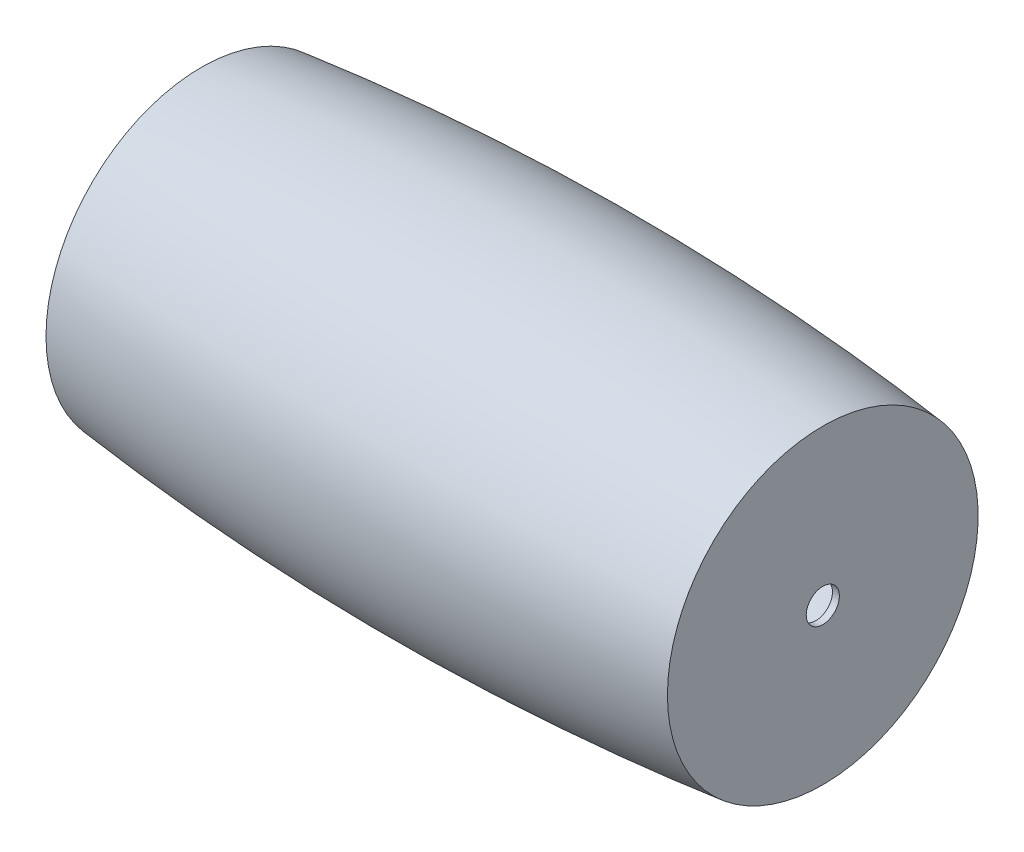
ISO-10303-21;
HEADER;
FILE_DESCRIPTION(('STEP AP214'),'2;1');
FILE_NAME('part.step','',(''),(''),'','','');
FILE_SCHEMA(('AUTOMOTIVE_DESIGN { 1 0 10303 214 1 1 1 1 }'));
ENDSEC;
DATA;
#1=APPLICATION_CONTEXT('core data for automotive mechanical design processes');
#2=APPLICATION_PROTOCOL_DEFINITION('international standard','automotive_design',2000,#1);
#3=PRODUCT_CONTEXT('',#1,'mechanical');
#4=PRODUCT('Part','Part','',(#3));
#5=PRODUCT_RELATED_PRODUCT_CATEGORY('part','',(#4));
#6=PRODUCT_DEFINITION_FORMATION('','',#4);
#7=PRODUCT_DEFINITION_CONTEXT('part definition',#1,'design');
#8=PRODUCT_DEFINITION('design','',#6,#7);
#9=PRODUCT_DEFINITION_SHAPE('','',#8);
#10=(LENGTH_UNIT() NAMED_UNIT(*) SI_UNIT(.MILLI.,.METRE.));
#11=(NAMED_UNIT(*) PLANE_ANGLE_UNIT() SI_UNIT($,.RADIAN.));
#12=(NAMED_UNIT(*) SI_UNIT($,.STERADIAN.) SOLID_ANGLE_UNIT());
#13=UNCERTAINTY_MEASURE_WITH_UNIT(LENGTH_MEASURE(1.E-05),#10,'distance_accuracy_value','');
#14=(GEOMETRIC_REPRESENTATION_CONTEXT(3) GLOBAL_UNCERTAINTY_ASSIGNED_CONTEXT((#13)) GLOBAL_UNIT_ASSIGNED_CONTEXT((#10,
#11,#12)) REPRESENTATION_CONTEXT('',''));
#15=CARTESIAN_POINT('',(0.,0.,0.));
#16=DIRECTION('',(0.,0.,1.));
#17=DIRECTION('',(1.,0.,0.));
#18=AXIS2_PLACEMENT_3D('',#15,#16,#17);
#19=CARTESIAN_POINT('',(450.,-193.017510099731,0.));
#20=DIRECTION('',(-1.,0.,0.));
#21=DIRECTION('',(0.,0.,1.));
#22=AXIS2_PLACEMENT_3D('',#19,#20,#21);
#23=DEGENERATE_TOROIDAL_SURFACE('',#22,3812.50000000001,4062.50000000001,.F.);
#24=CARTESIAN_POINT('',(0.,-193.017510099731,0.));
#25=DIRECTION('',(-1.,0.,0.));
#26=DIRECTION('',(0.,0.,1.));
#27=AXIS2_PLACEMENT_3D('',#24,#25,#26);
#28=CIRCLE('',#27,224.999999999999);
#29=CARTESIAN_POINT('',(0.,-193.017510099731,224.999999999999));
#30=VERTEX_POINT('',#29);
#31=EDGE_CURVE('E49',#30,#30,#28,.T.);
#32=ORIENTED_EDGE('',*,*,#31,.F.);
#33=EDGE_LOOP('',(#32));
#34=FACE_BOUND('',#33,.T.);
#35=CARTESIAN_POINT('',(900.,-193.017510099731,0.));
#36=DIRECTION('',(-1.,0.,0.));
#37=DIRECTION('',(0.,0.,1.));
#38=AXIS2_PLACEMENT_3D('',#35,#36,#37);
#39=CIRCLE('',#38,225.);
#40=CARTESIAN_POINT('',(900.,-193.017510099731,225.));
#41=VERTEX_POINT('',#40);
#42=EDGE_CURVE('E10',#41,#41,#39,.T.);
#43=ORIENTED_EDGE('',*,*,#42,.T.);
#44=EDGE_LOOP('',(#43));
#45=FACE_BOUND('',#44,.T.);
#46=ADVANCED_FACE('F33',(#34,#45),#23,.F.);
#47=CARTESIAN_POINT('',(900.,-193.017510099731,0.));
#48=DIRECTION('',(-1.,0.,0.));
#49=DIRECTION('',(0.,0.,1.));
#50=AXIS2_PLACEMENT_3D('',#47,#48,#49);
#51=PLANE('',#50);
#52=CARTESIAN_POINT('',(900.,-193.017510099731,0.));
#53=DIRECTION('',(-1.,0.,0.));
#54=DIRECTION('',(0.,-1.,0.));
#55=AXIS2_PLACEMENT_3D('',#52,#53,#54);
#56=CIRCLE('',#55,24.);
#57=CARTESIAN_POINT('',(900.,-217.017510099731,0.));
#58=VERTEX_POINT('',#57);
#59=EDGE_CURVE('E52',#58,#58,#56,.T.);
#60=ORIENTED_EDGE('',*,*,#59,.T.);
#61=EDGE_LOOP('',(#60));
#62=FACE_BOUND('',#61,.T.);
#63=ORIENTED_EDGE('',*,*,#42,.F.);
#64=EDGE_LOOP('',(#63));
#65=FACE_BOUND('',#64,.T.);
#66=ADVANCED_FACE('F74',(#62,#65),#51,.F.);
#67=CARTESIAN_POINT('',(890.,-193.017510099731,0.));
#68=DIRECTION('',(1.,0.,0.));
#69=DIRECTION('',(0.,0.,-1.));
#70=AXIS2_PLACEMENT_3D('',#67,#68,#69);
#71=PLANE('',#70);
#72=CARTESIAN_POINT('',(890.,-193.017510099731,0.));
#73=DIRECTION('',(1.,0.,0.));
#74=DIRECTION('',(0.,0.,-1.));
#75=AXIS2_PLACEMENT_3D('',#72,#73,#74);
#76=CIRCLE('',#75,24.);
#77=CARTESIAN_POINT('',(890.,-193.017510099731,-24.));
#78=VERTEX_POINT('',#77);
#79=EDGE_CURVE('E36',#78,#78,#76,.T.);
#80=ORIENTED_EDGE('',*,*,#79,.T.);
#81=EDGE_LOOP('',(#80));
#82=FACE_BOUND('',#81,.T.);
#83=CARTESIAN_POINT('',(890.,-193.017510099731,0.));
#84=DIRECTION('',(-1.,0.,0.));
#85=DIRECTION('',(0.,0.,1.));
#86=AXIS2_PLACEMENT_3D('',#83,#84,#85);
#87=CIRCLE('',#86,216.042695566226);
#88=CARTESIAN_POINT('',(890.,-193.017510099731,216.042695566226));
#89=VERTEX_POINT('',#88);
#90=EDGE_CURVE('E40',#89,#89,#87,.T.);
#91=ORIENTED_EDGE('',*,*,#90,.T.);
#92=EDGE_LOOP('',(#91));
#93=FACE_BOUND('',#92,.T.);
#94=ADVANCED_FACE('F59',(#82,#93),#71,.F.);
#95=CARTESIAN_POINT('',(450.,-193.017510099731,0.));
#96=DIRECTION('',(-1.,0.,0.));
#97=DIRECTION('',(0.,0.,1.));
#98=AXIS2_PLACEMENT_3D('',#95,#96,#97);
#99=DEGENERATE_TOROIDAL_SURFACE('',#98,3812.50000000001,4052.50000000001,.F.);
#100=ORIENTED_EDGE('',*,*,#90,.F.);
#101=EDGE_LOOP('',(#100));
#102=FACE_BOUND('',#101,.T.);
#103=CARTESIAN_POINT('',(0.,-193.017510099731,0.));
#104=DIRECTION('',(-1.,0.,0.));
#105=DIRECTION('',(0.,0.,1.));
#106=AXIS2_PLACEMENT_3D('',#103,#104,#105);
#107=CIRCLE('',#106,214.937926275214);
#108=CARTESIAN_POINT('',(0.,-193.017510099731,214.937926275214));
#109=VERTEX_POINT('',#108);
#110=EDGE_CURVE('E44',#109,#109,#107,.T.);
#111=ORIENTED_EDGE('',*,*,#110,.T.);
#112=EDGE_LOOP('',(#111));
#113=FACE_BOUND('',#112,.T.);
#114=ADVANCED_FACE('F70',(#102,#113),#99,.T.);
#115=CARTESIAN_POINT('',(0.,21.9204161754831,0.));
#116=DIRECTION('',(1.,0.,0.));
#117=DIRECTION('',(0.,0.,-1.));
#118=AXIS2_PLACEMENT_3D('',#115,#116,#117);
#119=PLANE('',#118);
#120=ORIENTED_EDGE('',*,*,#110,.F.);
#121=EDGE_LOOP('',(#120));
#122=FACE_BOUND('',#121,.T.);
#123=ORIENTED_EDGE('',*,*,#31,.T.);
#124=EDGE_LOOP('',(#123));
#125=FACE_BOUND('',#124,.T.);
#126=ADVANCED_FACE('F64',(#122,#125),#119,.F.);
#127=CARTESIAN_POINT('',(900.,-193.017510099731,0.));
#128=DIRECTION('',(-1.,0.,0.));
#129=DIRECTION('',(0.,-1.,0.));
#130=AXIS2_PLACEMENT_3D('',#127,#128,#129);
#131=CYLINDRICAL_SURFACE('',#130,24.);
#132=ORIENTED_EDGE('',*,*,#59,.F.);
#133=EDGE_LOOP('',(#132));
#134=FACE_BOUND('',#133,.T.);
#135=ORIENTED_EDGE('',*,*,#79,.F.);
#136=EDGE_LOOP('',(#135));
#137=FACE_BOUND('',#136,.T.);
#138=ADVANCED_FACE('F62',(#134,#137),#131,.F.);
#139=CLOSED_SHELL('',(#46,#66,#94,#114,#126,#138));
#140=MANIFOLD_SOLID_BREP('B2',#139);
#141=ADVANCED_BREP_SHAPE_REPRESENTATION('',(#18,#140),#14);
#142=SHAPE_DEFINITION_REPRESENTATION(#9,#141);
ENDSEC;
END-ISO-10303-21;
